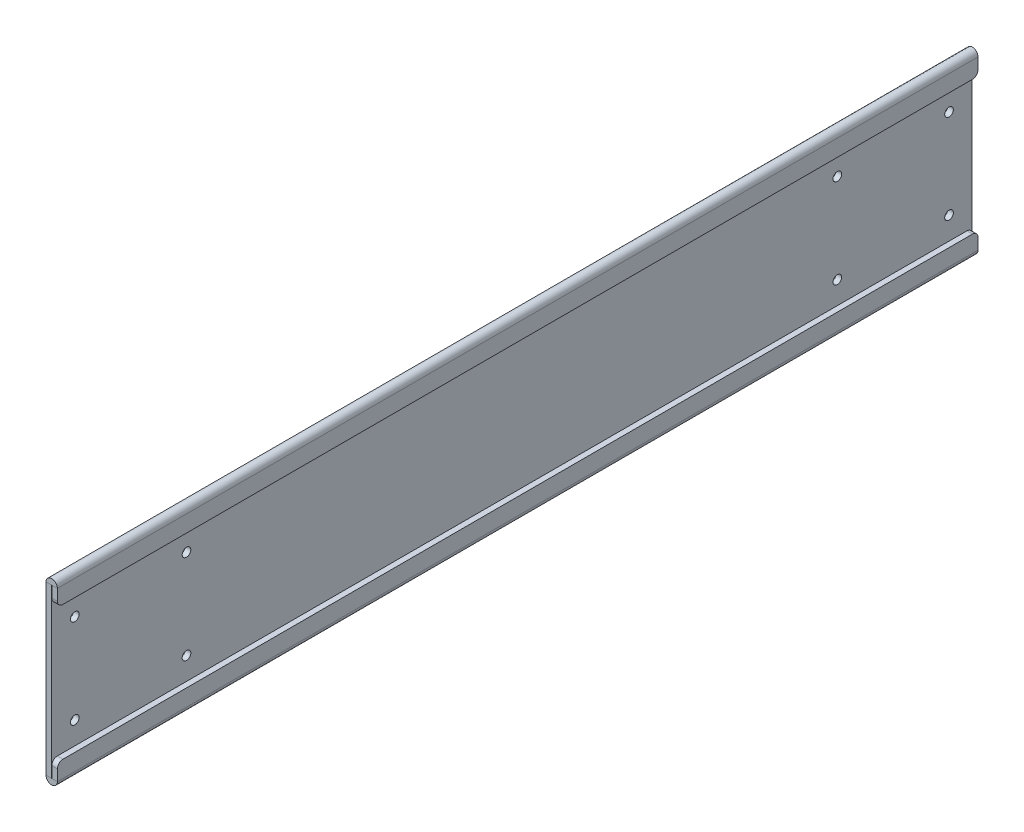
ISO-10303-21;
HEADER;
FILE_DESCRIPTION(('STEP AP214'),'2;1');
FILE_NAME('part.step','',(''),(''),'','','');
FILE_SCHEMA(('AUTOMOTIVE_DESIGN { 1 0 10303 214 1 1 1 1 }'));
ENDSEC;
DATA;
#1=APPLICATION_CONTEXT('core data for automotive mechanical design processes');
#2=APPLICATION_PROTOCOL_DEFINITION('international standard','automotive_design',2000,#1);
#3=PRODUCT_CONTEXT('',#1,'mechanical');
#4=PRODUCT('Part','Part','',(#3));
#5=PRODUCT_RELATED_PRODUCT_CATEGORY('part','',(#4));
#6=PRODUCT_DEFINITION_FORMATION('','',#4);
#7=PRODUCT_DEFINITION_CONTEXT('part definition',#1,'design');
#8=PRODUCT_DEFINITION('design','',#6,#7);
#9=PRODUCT_DEFINITION_SHAPE('','',#8);
#10=(LENGTH_UNIT() NAMED_UNIT(*) SI_UNIT(.MILLI.,.METRE.));
#11=(NAMED_UNIT(*) PLANE_ANGLE_UNIT() SI_UNIT($,.RADIAN.));
#12=(NAMED_UNIT(*) SI_UNIT($,.STERADIAN.) SOLID_ANGLE_UNIT());
#13=UNCERTAINTY_MEASURE_WITH_UNIT(LENGTH_MEASURE(1.E-05),#10,'distance_accuracy_value','');
#14=(GEOMETRIC_REPRESENTATION_CONTEXT(3) GLOBAL_UNCERTAINTY_ASSIGNED_CONTEXT((#13)) GLOBAL_UNIT_ASSIGNED_CONTEXT((#10,
#11,#12)) REPRESENTATION_CONTEXT('',''));
#15=CARTESIAN_POINT('',(0.,0.,0.));
#16=DIRECTION('',(0.,0.,1.));
#17=DIRECTION('',(1.,0.,0.));
#18=AXIS2_PLACEMENT_3D('',#15,#16,#17);
#19=CARTESIAN_POINT('',(-3.175,0.,0.));
#20=DIRECTION('',(0.,0.,-1.));
#21=DIRECTION('',(-1.,0.,0.));
#22=AXIS2_PLACEMENT_3D('',#19,#20,#21);
#23=PLANE('',#22);
#24=DIRECTION('',(0.,1.,0.));
#25=VECTOR('',#24,1.);
#26=CARTESIAN_POINT('',(0.,0.,0.));
#27=LINE('',#26,#25);
#28=CARTESIAN_POINT('',(0.,3.225,0.));
#29=VERTEX_POINT('',#28);
#30=CARTESIAN_POINT('',(0.,98.3749999999999,0.));
#31=VERTEX_POINT('',#30);
#32=EDGE_CURVE('E321',#29,#31,#27,.T.);
#33=ORIENTED_EDGE('',*,*,#32,.F.);
#34=DIRECTION('',(-1.,0.,0.));
#35=VECTOR('',#34,1.);
#36=CARTESIAN_POINT('',(0.,3.225,0.));
#37=LINE('',#36,#35);
#38=CARTESIAN_POINT('',(-3.175,3.225,0.));
#39=VERTEX_POINT('',#38);
#40=EDGE_CURVE('E191',#29,#39,#37,.T.);
#41=ORIENTED_EDGE('',*,*,#40,.T.);
#42=DIRECTION('',(0.,1.,0.));
#43=VECTOR('',#42,1.);
#44=CARTESIAN_POINT('',(-3.175,0.,0.));
#45=LINE('',#44,#43);
#46=CARTESIAN_POINT('',(-3.175,98.3749999999991,0.));
#47=VERTEX_POINT('',#46);
#48=EDGE_CURVE('E170',#39,#47,#45,.T.);
#49=ORIENTED_EDGE('',*,*,#48,.T.);
#50=DIRECTION('',(-1.,-2.7755575615629E-13,0.));
#51=VECTOR('',#50,1.);
#52=CARTESIAN_POINT('',(0.,98.3749999999999,0.));
#53=LINE('',#52,#51);
#54=EDGE_CURVE('E244',#31,#47,#53,.T.);
#55=ORIENTED_EDGE('',*,*,#54,.F.);
#56=EDGE_LOOP('',(#33,#41,#49,#55));
#57=FACE_BOUND('',#56,.T.);
#58=ADVANCED_FACE('F41',(#57),#23,.T.);
#59=CARTESIAN_POINT('',(-3.175,0.,523.3416));
#60=DIRECTION('',(0.,0.,1.));
#61=DIRECTION('',(1.,0.,0.));
#62=AXIS2_PLACEMENT_3D('',#59,#60,#61);
#63=PLANE('',#62);
#64=DIRECTION('',(-1.,0.,0.));
#65=VECTOR('',#64,1.);
#66=CARTESIAN_POINT('',(0.,3.225,523.3416));
#67=LINE('',#66,#65);
#68=CARTESIAN_POINT('',(0.,3.225,523.3416));
#69=VERTEX_POINT('',#68);
#70=CARTESIAN_POINT('',(-3.175,3.22500000000003,523.3416));
#71=VERTEX_POINT('',#70);
#72=EDGE_CURVE('E162',#69,#71,#67,.T.);
#73=ORIENTED_EDGE('',*,*,#72,.F.);
#74=DIRECTION('',(0.,-1.,0.));
#75=VECTOR('',#74,1.);
#76=CARTESIAN_POINT('',(0.,0.,523.3416));
#77=LINE('',#76,#75);
#78=CARTESIAN_POINT('',(0.,98.3749999999999,523.3416));
#79=VERTEX_POINT('',#78);
#80=EDGE_CURVE('E324',#79,#69,#77,.T.);
#81=ORIENTED_EDGE('',*,*,#80,.F.);
#82=DIRECTION('',(-1.,-2.7755575615629E-13,0.));
#83=VECTOR('',#82,1.);
#84=CARTESIAN_POINT('',(0.,98.3749999999999,523.3416));
#85=LINE('',#84,#83);
#86=CARTESIAN_POINT('',(-3.175,98.3749999999999,523.3416));
#87=VERTEX_POINT('',#86);
#88=EDGE_CURVE('E165',#79,#87,#85,.T.);
#89=ORIENTED_EDGE('',*,*,#88,.T.);
#90=DIRECTION('',(0.,-1.,0.));
#91=VECTOR('',#90,1.);
#92=CARTESIAN_POINT('',(-3.175,0.,523.3416));
#93=LINE('',#92,#91);
#94=EDGE_CURVE('E157',#87,#71,#93,.T.);
#95=ORIENTED_EDGE('',*,*,#94,.T.);
#96=EDGE_LOOP('',(#73,#81,#89,#95));
#97=FACE_BOUND('',#96,.T.);
#98=ADVANCED_FACE('F159',(#97),#63,.T.);
#99=CARTESIAN_POINT('',(-3.175,0.,0.));
#100=DIRECTION('',(1.,0.,0.));
#101=DIRECTION('',(0.,0.,-1.));
#102=AXIS2_PLACEMENT_3D('',#99,#100,#101);
#103=PLANE('',#102);
#104=CARTESIAN_POINT('',(-3.175,76.2,13.19149));
#105=DIRECTION('',(1.,0.,0.));
#106=DIRECTION('',(0.,0.,1.));
#107=AXIS2_PLACEMENT_3D('',#104,#105,#106);
#108=CIRCLE('',#107,2.45745000000001);
#109=CARTESIAN_POINT('',(-3.175,76.2,15.64894));
#110=VERTEX_POINT('',#109);
#111=EDGE_CURVE('E276',#110,#110,#108,.T.);
#112=ORIENTED_EDGE('',*,*,#111,.T.);
#113=EDGE_LOOP('',(#112));
#114=FACE_BOUND('',#113,.T.);
#115=CARTESIAN_POINT('',(-3.175,25.4,13.19149));
#116=DIRECTION('',(1.,0.,0.));
#117=DIRECTION('',(0.,0.,1.));
#118=AXIS2_PLACEMENT_3D('',#115,#116,#117);
#119=CIRCLE('',#118,2.45745000000001);
#120=CARTESIAN_POINT('',(-3.175,25.4,15.64894));
#121=VERTEX_POINT('',#120);
#122=EDGE_CURVE('E282',#121,#121,#119,.T.);
#123=ORIENTED_EDGE('',*,*,#122,.T.);
#124=EDGE_LOOP('',(#123));
#125=FACE_BOUND('',#124,.T.);
#126=CARTESIAN_POINT('',(-3.175,25.4,76.69149));
#127=DIRECTION('',(1.,0.,0.));
#128=DIRECTION('',(0.,0.,1.));
#129=AXIS2_PLACEMENT_3D('',#126,#127,#128);
#130=CIRCLE('',#129,2.45745000000001);
#131=CARTESIAN_POINT('',(-3.175,25.4,79.14894));
#132=VERTEX_POINT('',#131);
#133=EDGE_CURVE('E288',#132,#132,#130,.T.);
#134=ORIENTED_EDGE('',*,*,#133,.T.);
#135=EDGE_LOOP('',(#134));
#136=FACE_BOUND('',#135,.T.);
#137=CARTESIAN_POINT('',(-3.175,25.3999999999999,510.15011));
#138=DIRECTION('',(1.,0.,0.));
#139=DIRECTION('',(0.,0.,-1.));
#140=AXIS2_PLACEMENT_3D('',#137,#138,#139);
#141=CIRCLE('',#140,2.45745000000001);
#142=CARTESIAN_POINT('',(-3.175,25.3999999999999,507.69266));
#143=VERTEX_POINT('',#142);
#144=EDGE_CURVE('E294',#143,#143,#141,.T.);
#145=ORIENTED_EDGE('',*,*,#144,.T.);
#146=EDGE_LOOP('',(#145));
#147=FACE_BOUND('',#146,.T.);
#148=CARTESIAN_POINT('',(-3.175,25.3999999999999,446.65011));
#149=DIRECTION('',(1.,0.,0.));
#150=DIRECTION('',(0.,0.,-1.));
#151=AXIS2_PLACEMENT_3D('',#148,#149,#150);
#152=CIRCLE('',#151,2.45745000000002);
#153=CARTESIAN_POINT('',(-3.175,25.3999999999999,444.19266));
#154=VERTEX_POINT('',#153);
#155=EDGE_CURVE('E300',#154,#154,#152,.T.);
#156=ORIENTED_EDGE('',*,*,#155,.T.);
#157=EDGE_LOOP('',(#156));
#158=FACE_BOUND('',#157,.T.);
#159=CARTESIAN_POINT('',(-3.175,76.1999999999999,446.65011));
#160=DIRECTION('',(1.,0.,0.));
#161=DIRECTION('',(0.,0.,-1.));
#162=AXIS2_PLACEMENT_3D('',#159,#160,#161);
#163=CIRCLE('',#162,2.45745000000002);
#164=CARTESIAN_POINT('',(-3.175,76.1999999999999,444.19266));
#165=VERTEX_POINT('',#164);
#166=EDGE_CURVE('E306',#165,#165,#163,.T.);
#167=ORIENTED_EDGE('',*,*,#166,.T.);
#168=EDGE_LOOP('',(#167));
#169=FACE_BOUND('',#168,.T.);
#170=CARTESIAN_POINT('',(-3.175,76.2,76.69149));
#171=DIRECTION('',(1.,0.,0.));
#172=DIRECTION('',(0.,0.,1.));
#173=AXIS2_PLACEMENT_3D('',#170,#171,#172);
#174=CIRCLE('',#173,2.45745000000002);
#175=CARTESIAN_POINT('',(-3.175,76.2,79.14894));
#176=VERTEX_POINT('',#175);
#177=EDGE_CURVE('E312',#176,#176,#174,.T.);
#178=ORIENTED_EDGE('',*,*,#177,.T.);
#179=EDGE_LOOP('',(#178));
#180=FACE_BOUND('',#179,.T.);
#181=CARTESIAN_POINT('',(-3.175,76.1999999999999,510.15011));
#182=DIRECTION('',(1.,0.,0.));
#183=DIRECTION('',(0.,0.,-1.));
#184=AXIS2_PLACEMENT_3D('',#181,#182,#183);
#185=CIRCLE('',#184,2.45745000000001);
#186=CARTESIAN_POINT('',(-3.175,76.1999999999999,507.69266));
#187=VERTEX_POINT('',#186);
#188=EDGE_CURVE('E318',#187,#187,#185,.T.);
#189=ORIENTED_EDGE('',*,*,#188,.T.);
#190=EDGE_LOOP('',(#189));
#191=FACE_BOUND('',#190,.T.);
#192=ORIENTED_EDGE('',*,*,#48,.F.);
#193=DIRECTION('',(0.,0.,-1.));
#194=VECTOR('',#193,1.);
#195=CARTESIAN_POINT('',(-3.175,3.22500000000003,0.));
#196=LINE('',#195,#194);
#197=EDGE_CURVE('E174',#39,#71,#196,.F.);
#198=ORIENTED_EDGE('',*,*,#197,.T.);
#199=ORIENTED_EDGE('',*,*,#94,.F.);
#200=DIRECTION('',(0.,0.,1.));
#201=VECTOR('',#200,1.);
#202=CARTESIAN_POINT('',(-3.175,98.3749999999991,523.3416));
#203=LINE('',#202,#201);
#204=EDGE_CURVE('E228',#87,#47,#203,.F.);
#205=ORIENTED_EDGE('',*,*,#204,.T.);
#206=EDGE_LOOP('',(#192,#198,#199,#205));
#207=FACE_BOUND('',#206,.T.);
#208=ADVANCED_FACE('F175',(#114,#125,#136,#147,#158,#169,#180,#191,#207),#103,.F.);
#209=CARTESIAN_POINT('',(0.,0.,0.));
#210=DIRECTION('',(1.,0.,0.));
#211=DIRECTION('',(0.,0.,-1.));
#212=AXIS2_PLACEMENT_3D('',#209,#210,#211);
#213=PLANE('',#212);
#214=DIRECTION('',(0.,0.,-1.));
#215=VECTOR('',#214,1.);
#216=CARTESIAN_POINT('',(0.,3.225,0.));
#217=LINE('',#216,#215);
#218=EDGE_CURVE('E202',#29,#69,#217,.F.);
#219=ORIENTED_EDGE('',*,*,#218,.F.);
#220=ORIENTED_EDGE('',*,*,#32,.T.);
#221=DIRECTION('',(0.,0.,1.));
#222=VECTOR('',#221,1.);
#223=CARTESIAN_POINT('',(0.,98.3749999999999,523.3416));
#224=LINE('',#223,#222);
#225=EDGE_CURVE('E239',#79,#31,#224,.F.);
#226=ORIENTED_EDGE('',*,*,#225,.F.);
#227=ORIENTED_EDGE('',*,*,#80,.T.);
#228=EDGE_LOOP('',(#219,#220,#226,#227));
#229=FACE_BOUND('',#228,.T.);
#230=CARTESIAN_POINT('',(0.,76.2,13.19149));
#231=DIRECTION('',(1.,0.,0.));
#232=DIRECTION('',(0.,0.,1.));
#233=AXIS2_PLACEMENT_3D('',#230,#231,#232);
#234=CIRCLE('',#233,2.45745000000001);
#235=CARTESIAN_POINT('',(0.,76.2,15.64894));
#236=VERTEX_POINT('',#235);
#237=EDGE_CURVE('E275',#236,#236,#234,.T.);
#238=ORIENTED_EDGE('',*,*,#237,.F.);
#239=EDGE_LOOP('',(#238));
#240=FACE_BOUND('',#239,.T.);
#241=CARTESIAN_POINT('',(0.,25.4,13.19149));
#242=DIRECTION('',(1.,0.,0.));
#243=DIRECTION('',(0.,0.,1.));
#244=AXIS2_PLACEMENT_3D('',#241,#242,#243);
#245=CIRCLE('',#244,2.45745000000001);
#246=CARTESIAN_POINT('',(0.,25.4,15.64894));
#247=VERTEX_POINT('',#246);
#248=EDGE_CURVE('E279',#247,#247,#245,.T.);
#249=ORIENTED_EDGE('',*,*,#248,.F.);
#250=EDGE_LOOP('',(#249));
#251=FACE_BOUND('',#250,.T.);
#252=CARTESIAN_POINT('',(0.,25.4,76.69149));
#253=DIRECTION('',(1.,0.,0.));
#254=DIRECTION('',(0.,0.,1.));
#255=AXIS2_PLACEMENT_3D('',#252,#253,#254);
#256=CIRCLE('',#255,2.45745000000001);
#257=CARTESIAN_POINT('',(0.,25.4,79.14894));
#258=VERTEX_POINT('',#257);
#259=EDGE_CURVE('E285',#258,#258,#256,.T.);
#260=ORIENTED_EDGE('',*,*,#259,.F.);
#261=EDGE_LOOP('',(#260));
#262=FACE_BOUND('',#261,.T.);
#263=CARTESIAN_POINT('',(0.,25.3999999999999,510.15011));
#264=DIRECTION('',(1.,0.,0.));
#265=DIRECTION('',(0.,0.,-1.));
#266=AXIS2_PLACEMENT_3D('',#263,#264,#265);
#267=CIRCLE('',#266,2.45745000000001);
#268=CARTESIAN_POINT('',(0.,25.3999999999999,507.69266));
#269=VERTEX_POINT('',#268);
#270=EDGE_CURVE('E291',#269,#269,#267,.T.);
#271=ORIENTED_EDGE('',*,*,#270,.F.);
#272=EDGE_LOOP('',(#271));
#273=FACE_BOUND('',#272,.T.);
#274=CARTESIAN_POINT('',(0.,25.3999999999999,446.65011));
#275=DIRECTION('',(1.,0.,0.));
#276=DIRECTION('',(0.,0.,-1.));
#277=AXIS2_PLACEMENT_3D('',#274,#275,#276);
#278=CIRCLE('',#277,2.45745000000002);
#279=CARTESIAN_POINT('',(0.,25.3999999999999,444.19266));
#280=VERTEX_POINT('',#279);
#281=EDGE_CURVE('E297',#280,#280,#278,.T.);
#282=ORIENTED_EDGE('',*,*,#281,.F.);
#283=EDGE_LOOP('',(#282));
#284=FACE_BOUND('',#283,.T.);
#285=CARTESIAN_POINT('',(0.,76.1999999999999,446.65011));
#286=DIRECTION('',(1.,0.,0.));
#287=DIRECTION('',(0.,0.,-1.));
#288=AXIS2_PLACEMENT_3D('',#285,#286,#287);
#289=CIRCLE('',#288,2.45745000000002);
#290=CARTESIAN_POINT('',(0.,76.1999999999999,444.19266));
#291=VERTEX_POINT('',#290);
#292=EDGE_CURVE('E303',#291,#291,#289,.T.);
#293=ORIENTED_EDGE('',*,*,#292,.F.);
#294=EDGE_LOOP('',(#293));
#295=FACE_BOUND('',#294,.T.);
#296=CARTESIAN_POINT('',(0.,76.2,76.69149));
#297=DIRECTION('',(1.,0.,0.));
#298=DIRECTION('',(0.,0.,1.));
#299=AXIS2_PLACEMENT_3D('',#296,#297,#298);
#300=CIRCLE('',#299,2.45745000000002);
#301=CARTESIAN_POINT('',(0.,76.2,79.14894));
#302=VERTEX_POINT('',#301);
#303=EDGE_CURVE('E309',#302,#302,#300,.T.);
#304=ORIENTED_EDGE('',*,*,#303,.F.);
#305=EDGE_LOOP('',(#304));
#306=FACE_BOUND('',#305,.T.);
#307=CARTESIAN_POINT('',(0.,76.1999999999999,510.15011));
#308=DIRECTION('',(1.,0.,0.));
#309=DIRECTION('',(0.,0.,-1.));
#310=AXIS2_PLACEMENT_3D('',#307,#308,#309);
#311=CIRCLE('',#310,2.45745000000001);
#312=CARTESIAN_POINT('',(0.,76.1999999999999,507.69266));
#313=VERTEX_POINT('',#312);
#314=EDGE_CURVE('E315',#313,#313,#311,.T.);
#315=ORIENTED_EDGE('',*,*,#314,.F.);
#316=EDGE_LOOP('',(#315));
#317=FACE_BOUND('',#316,.T.);
#318=ADVANCED_FACE('F382',(#229,#240,#251,#262,#273,#284,#295,#306,#317),#213,.T.);
#319=CARTESIAN_POINT('',(-3.175,76.1999999999999,510.15011));
#320=DIRECTION('',(1.,0.,0.));
#321=DIRECTION('',(0.,0.,-1.));
#322=AXIS2_PLACEMENT_3D('',#319,#320,#321);
#323=CYLINDRICAL_SURFACE('',#322,2.45745000000001);
#324=ORIENTED_EDGE('',*,*,#188,.F.);
#325=EDGE_LOOP('',(#324));
#326=FACE_BOUND('',#325,.T.);
#327=ORIENTED_EDGE('',*,*,#314,.T.);
#328=EDGE_LOOP('',(#327));
#329=FACE_BOUND('',#328,.T.);
#330=ADVANCED_FACE('F497',(#326,#329),#323,.F.);
#331=CARTESIAN_POINT('',(-3.175,76.2,76.69149));
#332=DIRECTION('',(1.,0.,0.));
#333=DIRECTION('',(0.,0.,-1.));
#334=AXIS2_PLACEMENT_3D('',#331,#332,#333);
#335=CYLINDRICAL_SURFACE('',#334,2.45745000000002);
#336=ORIENTED_EDGE('',*,*,#177,.F.);
#337=EDGE_LOOP('',(#336));
#338=FACE_BOUND('',#337,.T.);
#339=ORIENTED_EDGE('',*,*,#303,.T.);
#340=EDGE_LOOP('',(#339));
#341=FACE_BOUND('',#340,.T.);
#342=ADVANCED_FACE('F493',(#338,#341),#335,.F.);
#343=CARTESIAN_POINT('',(-3.175,76.1999999999999,446.65011));
#344=DIRECTION('',(1.,0.,0.));
#345=DIRECTION('',(0.,0.,-1.));
#346=AXIS2_PLACEMENT_3D('',#343,#344,#345);
#347=CYLINDRICAL_SURFACE('',#346,2.45745000000002);
#348=ORIENTED_EDGE('',*,*,#166,.F.);
#349=EDGE_LOOP('',(#348));
#350=FACE_BOUND('',#349,.T.);
#351=ORIENTED_EDGE('',*,*,#292,.T.);
#352=EDGE_LOOP('',(#351));
#353=FACE_BOUND('',#352,.T.);
#354=ADVANCED_FACE('F489',(#350,#353),#347,.F.);
#355=CARTESIAN_POINT('',(-3.175,25.3999999999999,446.65011));
#356=DIRECTION('',(1.,0.,0.));
#357=DIRECTION('',(0.,0.,-1.));
#358=AXIS2_PLACEMENT_3D('',#355,#356,#357);
#359=CYLINDRICAL_SURFACE('',#358,2.45745000000002);
#360=ORIENTED_EDGE('',*,*,#155,.F.);
#361=EDGE_LOOP('',(#360));
#362=FACE_BOUND('',#361,.T.);
#363=ORIENTED_EDGE('',*,*,#281,.T.);
#364=EDGE_LOOP('',(#363));
#365=FACE_BOUND('',#364,.T.);
#366=ADVANCED_FACE('F485',(#362,#365),#359,.F.);
#367=CARTESIAN_POINT('',(-3.175,25.3999999999999,510.15011));
#368=DIRECTION('',(1.,0.,0.));
#369=DIRECTION('',(0.,0.,-1.));
#370=AXIS2_PLACEMENT_3D('',#367,#368,#369);
#371=CYLINDRICAL_SURFACE('',#370,2.45745000000001);
#372=ORIENTED_EDGE('',*,*,#144,.F.);
#373=EDGE_LOOP('',(#372));
#374=FACE_BOUND('',#373,.T.);
#375=ORIENTED_EDGE('',*,*,#270,.T.);
#376=EDGE_LOOP('',(#375));
#377=FACE_BOUND('',#376,.T.);
#378=ADVANCED_FACE('F481',(#374,#377),#371,.F.);
#379=CARTESIAN_POINT('',(-3.175,25.4,76.69149));
#380=DIRECTION('',(1.,0.,0.));
#381=DIRECTION('',(0.,0.,-1.));
#382=AXIS2_PLACEMENT_3D('',#379,#380,#381);
#383=CYLINDRICAL_SURFACE('',#382,2.45745000000001);
#384=ORIENTED_EDGE('',*,*,#133,.F.);
#385=EDGE_LOOP('',(#384));
#386=FACE_BOUND('',#385,.T.);
#387=ORIENTED_EDGE('',*,*,#259,.T.);
#388=EDGE_LOOP('',(#387));
#389=FACE_BOUND('',#388,.T.);
#390=ADVANCED_FACE('F477',(#386,#389),#383,.F.);
#391=CARTESIAN_POINT('',(-3.175,25.4,13.19149));
#392=DIRECTION('',(1.,0.,0.));
#393=DIRECTION('',(0.,0.,-1.));
#394=AXIS2_PLACEMENT_3D('',#391,#392,#393);
#395=CYLINDRICAL_SURFACE('',#394,2.45745000000001);
#396=ORIENTED_EDGE('',*,*,#122,.F.);
#397=EDGE_LOOP('',(#396));
#398=FACE_BOUND('',#397,.T.);
#399=ORIENTED_EDGE('',*,*,#248,.T.);
#400=EDGE_LOOP('',(#399));
#401=FACE_BOUND('',#400,.T.);
#402=ADVANCED_FACE('F473',(#398,#401),#395,.F.);
#403=CARTESIAN_POINT('',(-3.175,76.2,13.19149));
#404=DIRECTION('',(1.,0.,0.));
#405=DIRECTION('',(0.,0.,-1.));
#406=AXIS2_PLACEMENT_3D('',#403,#404,#405);
#407=CYLINDRICAL_SURFACE('',#406,2.45745000000001);
#408=ORIENTED_EDGE('',*,*,#111,.F.);
#409=EDGE_LOOP('',(#408));
#410=FACE_BOUND('',#409,.T.);
#411=ORIENTED_EDGE('',*,*,#237,.T.);
#412=EDGE_LOOP('',(#411));
#413=FACE_BOUND('',#412,.T.);
#414=ADVANCED_FACE('F470',(#410,#413),#407,.F.);
#415=CARTESIAN_POINT('',(3.275,93.6374999999999,523.3416));
#416=DIRECTION('',(0.,0.,-1.));
#417=DIRECTION('',(0.,1.,0.));
#418=AXIS2_PLACEMENT_3D('',#415,#416,#417);
#419=PLANE('',#418);
#420=DIRECTION('',(0.,1.,0.));
#421=VECTOR('',#420,1.);
#422=CARTESIAN_POINT('',(0.0999999999999998,93.6375,523.3416));
#423=LINE('',#422,#421);
#424=CARTESIAN_POINT('',(0.0999999999999998,92.0749999999999,523.3416));
#425=VERTEX_POINT('',#424);
#426=CARTESIAN_POINT('',(0.0999999999999998,98.3749999999999,523.3416));
#427=VERTEX_POINT('',#426);
#428=EDGE_CURVE('E264',#425,#427,#423,.T.);
#429=ORIENTED_EDGE('',*,*,#428,.F.);
#430=DIRECTION('',(-1.,0.,0.));
#431=VECTOR('',#430,1.);
#432=CARTESIAN_POINT('',(3.275,92.0749999999999,523.3416));
#433=LINE('',#432,#431);
#434=CARTESIAN_POINT('',(3.275,92.0749999999999,523.3416));
#435=VERTEX_POINT('',#434);
#436=EDGE_CURVE('E11',#425,#435,#433,.F.);
#437=ORIENTED_EDGE('',*,*,#436,.T.);
#438=DIRECTION('',(0.,1.,0.));
#439=VECTOR('',#438,1.);
#440=CARTESIAN_POINT('',(3.275,93.6374999999999,523.3416));
#441=LINE('',#440,#439);
#442=CARTESIAN_POINT('',(3.275,98.3749999999999,523.3416));
#443=VERTEX_POINT('',#442);
#444=EDGE_CURVE('E253',#435,#443,#441,.T.);
#445=ORIENTED_EDGE('',*,*,#444,.T.);
#446=DIRECTION('',(1.,0.,0.));
#447=VECTOR('',#446,1.);
#448=CARTESIAN_POINT('',(3.275,98.3749999999999,523.3416));
#449=LINE('',#448,#447);
#450=EDGE_CURVE('E252',#427,#443,#449,.T.);
#451=ORIENTED_EDGE('',*,*,#450,.F.);
#452=EDGE_LOOP('',(#429,#437,#445,#451));
#453=FACE_BOUND('',#452,.T.);
#454=ADVANCED_FACE('F428',(#453),#419,.F.);
#455=CARTESIAN_POINT('',(3.275,88.8999999999999,261.6708));
#456=DIRECTION('',(0.,1.,0.));
#457=DIRECTION('',(0.,0.,1.));
#458=AXIS2_PLACEMENT_3D('',#455,#456,#457);
#459=PLANE('',#458);
#460=DIRECTION('',(0.,0.,-1.));
#461=VECTOR('',#460,1.);
#462=CARTESIAN_POINT('',(0.0999999999999998,88.9,261.6708));
#463=LINE('',#462,#461);
#464=CARTESIAN_POINT('',(0.0999999999999998,88.9,3.17499999999998));
#465=VERTEX_POINT('',#464);
#466=CARTESIAN_POINT('',(0.0999999999999998,88.9,520.1666));
#467=VERTEX_POINT('',#466);
#468=EDGE_CURVE('E261',#465,#467,#463,.F.);
#469=ORIENTED_EDGE('',*,*,#468,.F.);
#470=DIRECTION('',(-1.,0.,0.));
#471=VECTOR('',#470,1.);
#472=CARTESIAN_POINT('',(3.275,88.9,3.17499999999998));
#473=LINE('',#472,#471);
#474=CARTESIAN_POINT('',(3.275,88.9,3.17499999999998));
#475=VERTEX_POINT('',#474);
#476=EDGE_CURVE('E329',#465,#475,#473,.F.);
#477=ORIENTED_EDGE('',*,*,#476,.T.);
#478=DIRECTION('',(0.,0.,1.));
#479=VECTOR('',#478,1.);
#480=CARTESIAN_POINT('',(3.275,88.8999999999999,261.6708));
#481=LINE('',#480,#479);
#482=CARTESIAN_POINT('',(3.275,88.8999999999999,520.1666));
#483=VERTEX_POINT('',#482);
#484=EDGE_CURVE('E249',#475,#483,#481,.T.);
#485=ORIENTED_EDGE('',*,*,#484,.T.);
#486=DIRECTION('',(-1.,0.,0.));
#487=VECTOR('',#486,1.);
#488=CARTESIAN_POINT('',(3.275,88.8999999999999,520.1666));
#489=LINE('',#488,#487);
#490=EDGE_CURVE('E169',#483,#467,#489,.T.);
#491=ORIENTED_EDGE('',*,*,#490,.T.);
#492=EDGE_LOOP('',(#469,#477,#485,#491));
#493=FACE_BOUND('',#492,.T.);
#494=ADVANCED_FACE('F453',(#493),#459,.F.);
#495=CARTESIAN_POINT('',(3.275,93.6375,0.));
#496=DIRECTION('',(0.,0.,1.));
#497=DIRECTION('',(0.,-1.,0.));
#498=AXIS2_PLACEMENT_3D('',#495,#496,#497);
#499=PLANE('',#498);
#500=DIRECTION('',(0.,-1.,0.));
#501=VECTOR('',#500,1.);
#502=CARTESIAN_POINT('',(3.275,93.6375,0.));
#503=LINE('',#502,#501);
#504=CARTESIAN_POINT('',(3.275,98.3749999999999,0.));
#505=VERTEX_POINT('',#504);
#506=CARTESIAN_POINT('',(3.275,92.075,0.));
#507=VERTEX_POINT('',#506);
#508=EDGE_CURVE('E258',#505,#507,#503,.T.);
#509=ORIENTED_EDGE('',*,*,#508,.T.);
#510=DIRECTION('',(-1.,0.,0.));
#511=VECTOR('',#510,1.);
#512=CARTESIAN_POINT('',(3.275,92.075,0.));
#513=LINE('',#512,#511);
#514=CARTESIAN_POINT('',(0.0999999999999998,92.075,0.));
#515=VERTEX_POINT('',#514);
#516=EDGE_CURVE('E336',#507,#515,#513,.T.);
#517=ORIENTED_EDGE('',*,*,#516,.T.);
#518=DIRECTION('',(0.,1.,0.));
#519=VECTOR('',#518,1.);
#520=CARTESIAN_POINT('',(0.0999999999999998,93.6375,0.));
#521=LINE('',#520,#519);
#522=CARTESIAN_POINT('',(0.0999999999999998,98.375,0.));
#523=VERTEX_POINT('',#522);
#524=EDGE_CURVE('E247',#523,#515,#521,.F.);
#525=ORIENTED_EDGE('',*,*,#524,.F.);
#526=DIRECTION('',(1.,0.,0.));
#527=VECTOR('',#526,1.);
#528=CARTESIAN_POINT('',(3.275,98.375,0.));
#529=LINE('',#528,#527);
#530=EDGE_CURVE('E272',#523,#505,#529,.T.);
#531=ORIENTED_EDGE('',*,*,#530,.T.);
#532=EDGE_LOOP('',(#509,#517,#525,#531));
#533=FACE_BOUND('',#532,.T.);
#534=ADVANCED_FACE('F447',(#533),#499,.F.);
#535=CARTESIAN_POINT('',(3.275,93.6375,261.6708));
#536=DIRECTION('',(1.,0.,0.));
#537=DIRECTION('',(0.,0.,-1.));
#538=AXIS2_PLACEMENT_3D('',#535,#536,#537);
#539=PLANE('',#538);
#540=ORIENTED_EDGE('',*,*,#484,.F.);
#541=CARTESIAN_POINT('',(3.275,92.075,3.17499999999998));
#542=DIRECTION('',(1.,0.,0.));
#543=DIRECTION('',(0.,0.,-1.));
#544=AXIS2_PLACEMENT_3D('',#541,#542,#543);
#545=CIRCLE('',#544,3.175);
#546=EDGE_CURVE('E334',#475,#507,#545,.T.);
#547=ORIENTED_EDGE('',*,*,#546,.T.);
#548=ORIENTED_EDGE('',*,*,#508,.F.);
#549=DIRECTION('',(0.,0.,-1.));
#550=VECTOR('',#549,1.);
#551=CARTESIAN_POINT('',(3.275,98.375,261.6708));
#552=LINE('',#551,#550);
#553=EDGE_CURVE('E255',#443,#505,#552,.T.);
#554=ORIENTED_EDGE('',*,*,#553,.F.);
#555=ORIENTED_EDGE('',*,*,#444,.F.);
#556=CARTESIAN_POINT('',(3.275,92.0749999999999,520.1666));
#557=DIRECTION('',(1.,0.,0.));
#558=DIRECTION('',(0.,0.,-1.));
#559=AXIS2_PLACEMENT_3D('',#556,#557,#558);
#560=CIRCLE('',#559,3.175);
#561=EDGE_CURVE('E332',#435,#483,#560,.T.);
#562=ORIENTED_EDGE('',*,*,#561,.T.);
#563=EDGE_LOOP('',(#540,#547,#548,#554,#555,#562));
#564=FACE_BOUND('',#563,.T.);
#565=ADVANCED_FACE('F455',(#564),#539,.T.);
#566=CARTESIAN_POINT('',(0.0999999999999998,93.6375,261.6708));
#567=DIRECTION('',(1.,0.,0.));
#568=DIRECTION('',(0.,0.,-1.));
#569=AXIS2_PLACEMENT_3D('',#566,#567,#568);
#570=PLANE('',#569);
#571=ORIENTED_EDGE('',*,*,#524,.T.);
#572=CARTESIAN_POINT('',(0.0999999999999998,92.075,3.17499999999998));
#573=DIRECTION('',(1.,0.,0.));
#574=DIRECTION('',(0.,0.,-1.));
#575=AXIS2_PLACEMENT_3D('',#572,#573,#574);
#576=CIRCLE('',#575,3.175);
#577=EDGE_CURVE('E340',#515,#465,#576,.F.);
#578=ORIENTED_EDGE('',*,*,#577,.T.);
#579=ORIENTED_EDGE('',*,*,#468,.T.);
#580=CARTESIAN_POINT('',(0.0999999999999998,92.0749999999999,520.1666));
#581=DIRECTION('',(1.,0.,0.));
#582=DIRECTION('',(0.,0.,-1.));
#583=AXIS2_PLACEMENT_3D('',#580,#581,#582);
#584=CIRCLE('',#583,3.175);
#585=EDGE_CURVE('E338',#467,#425,#584,.F.);
#586=ORIENTED_EDGE('',*,*,#585,.T.);
#587=ORIENTED_EDGE('',*,*,#428,.T.);
#588=DIRECTION('',(0.,0.,-1.));
#589=VECTOR('',#588,1.);
#590=CARTESIAN_POINT('',(0.0999999999999998,98.3749999999999,261.6708));
#591=LINE('',#590,#589);
#592=EDGE_CURVE('E266',#427,#523,#591,.T.);
#593=ORIENTED_EDGE('',*,*,#592,.T.);
#594=EDGE_LOOP('',(#571,#578,#579,#586,#587,#593));
#595=FACE_BOUND('',#594,.T.);
#596=ADVANCED_FACE('F424',(#595),#570,.F.);
#597=CARTESIAN_POINT('',(0.0499999999999999,98.3749999999999,0.));
#598=DIRECTION('',(0.,0.,-1.));
#599=DIRECTION('',(-1.,0.,0.));
#600=AXIS2_PLACEMENT_3D('',#597,#598,#599);
#601=PLANE('',#600);
#602=ORIENTED_EDGE('',*,*,#530,.F.);
#603=CARTESIAN_POINT('',(0.0499999999999999,98.3749999999999,0.));
#604=DIRECTION('',(0.,0.,1.));
#605=DIRECTION('',(1.,0.,0.));
#606=AXIS2_PLACEMENT_3D('',#603,#604,#605);
#607=CIRCLE('',#606,0.0499999999999999);
#608=EDGE_CURVE('E236',#31,#523,#607,.F.);
#609=ORIENTED_EDGE('',*,*,#608,.F.);
#610=ORIENTED_EDGE('',*,*,#54,.T.);
#611=CARTESIAN_POINT('',(0.0499999999999999,98.3749999999999,0.));
#612=DIRECTION('',(0.,0.,1.));
#613=DIRECTION('',(1.,0.,0.));
#614=AXIS2_PLACEMENT_3D('',#611,#612,#613);
#615=CIRCLE('',#614,3.225);
#616=EDGE_CURVE('E230',#47,#505,#615,.F.);
#617=ORIENTED_EDGE('',*,*,#616,.T.);
#618=EDGE_LOOP('',(#602,#609,#610,#617));
#619=FACE_BOUND('',#618,.T.);
#620=ADVANCED_FACE('F445',(#619),#601,.T.);
#621=CARTESIAN_POINT('',(0.0499999999999999,98.3749999999999,523.3416));
#622=DIRECTION('',(0.,0.,-1.));
#623=DIRECTION('',(-1.,0.,0.));
#624=AXIS2_PLACEMENT_3D('',#621,#622,#623);
#625=PLANE('',#624);
#626=CARTESIAN_POINT('',(0.0499999999999999,98.3749999999999,523.3416));
#627=DIRECTION('',(0.,0.,1.));
#628=DIRECTION('',(1.,0.,0.));
#629=AXIS2_PLACEMENT_3D('',#626,#627,#628);
#630=CIRCLE('',#629,0.0499999999999999);
#631=EDGE_CURVE('E227',#427,#79,#630,.T.);
#632=ORIENTED_EDGE('',*,*,#631,.F.);
#633=ORIENTED_EDGE('',*,*,#450,.T.);
#634=CARTESIAN_POINT('',(0.0499999999999999,98.3749999999999,523.3416));
#635=DIRECTION('',(0.,0.,1.));
#636=DIRECTION('',(1.,0.,0.));
#637=AXIS2_PLACEMENT_3D('',#634,#635,#636);
#638=CIRCLE('',#637,3.225);
#639=EDGE_CURVE('E231',#443,#87,#638,.T.);
#640=ORIENTED_EDGE('',*,*,#639,.T.);
#641=ORIENTED_EDGE('',*,*,#88,.F.);
#642=EDGE_LOOP('',(#632,#633,#640,#641));
#643=FACE_BOUND('',#642,.T.);
#644=ADVANCED_FACE('F439',(#643),#625,.F.);
#645=CARTESIAN_POINT('',(0.0499999999999999,98.3749999999999,523.3416));
#646=DIRECTION('',(0.,0.,1.));
#647=DIRECTION('',(1.,0.,0.));
#648=AXIS2_PLACEMENT_3D('',#645,#646,#647);
#649=CYLINDRICAL_SURFACE('',#648,3.225);
#650=ORIENTED_EDGE('',*,*,#204,.F.);
#651=ORIENTED_EDGE('',*,*,#639,.F.);
#652=ORIENTED_EDGE('',*,*,#553,.T.);
#653=ORIENTED_EDGE('',*,*,#616,.F.);
#654=EDGE_LOOP('',(#650,#651,#652,#653));
#655=FACE_BOUND('',#654,.T.);
#656=ADVANCED_FACE('F441',(#655),#649,.T.);
#657=CARTESIAN_POINT('',(0.0499999999999999,98.3749999999999,523.3416));
#658=DIRECTION('',(0.,0.,1.));
#659=DIRECTION('',(1.,0.,0.));
#660=AXIS2_PLACEMENT_3D('',#657,#658,#659);
#661=CYLINDRICAL_SURFACE('',#660,0.0499999999999999);
#662=ORIENTED_EDGE('',*,*,#225,.T.);
#663=ORIENTED_EDGE('',*,*,#608,.T.);
#664=ORIENTED_EDGE('',*,*,#592,.F.);
#665=ORIENTED_EDGE('',*,*,#631,.T.);
#666=EDGE_LOOP('',(#662,#663,#664,#665));
#667=FACE_BOUND('',#666,.T.);
#668=ADVANCED_FACE('F436',(#667),#661,.F.);
#669=CARTESIAN_POINT('',(3.275,7.9625,0.));
#670=DIRECTION('',(0.,0.,1.));
#671=DIRECTION('',(0.,-1.,0.));
#672=AXIS2_PLACEMENT_3D('',#669,#670,#671);
#673=PLANE('',#672);
#674=DIRECTION('',(0.,1.,0.));
#675=VECTOR('',#674,1.);
#676=CARTESIAN_POINT('',(0.0999999999999998,7.9625,0.));
#677=LINE('',#676,#675);
#678=CARTESIAN_POINT('',(0.0999999999999998,9.525,0.));
#679=VERTEX_POINT('',#678);
#680=CARTESIAN_POINT('',(0.0999999999999998,3.225,0.));
#681=VERTEX_POINT('',#680);
#682=EDGE_CURVE('E217',#679,#681,#677,.F.);
#683=ORIENTED_EDGE('',*,*,#682,.F.);
#684=DIRECTION('',(-1.,0.,0.));
#685=VECTOR('',#684,1.);
#686=CARTESIAN_POINT('',(3.275,9.525,0.));
#687=LINE('',#686,#685);
#688=CARTESIAN_POINT('',(3.275,9.525,0.));
#689=VERTEX_POINT('',#688);
#690=EDGE_CURVE('E342',#679,#689,#687,.F.);
#691=ORIENTED_EDGE('',*,*,#690,.T.);
#692=DIRECTION('',(0.,-1.,0.));
#693=VECTOR('',#692,1.);
#694=CARTESIAN_POINT('',(3.275,7.9625,0.));
#695=LINE('',#694,#693);
#696=CARTESIAN_POINT('',(3.275,3.225,0.));
#697=VERTEX_POINT('',#696);
#698=EDGE_CURVE('E210',#689,#697,#695,.T.);
#699=ORIENTED_EDGE('',*,*,#698,.T.);
#700=DIRECTION('',(1.,0.,0.));
#701=VECTOR('',#700,1.);
#702=CARTESIAN_POINT('',(3.275,3.225,0.));
#703=LINE('',#702,#701);
#704=EDGE_CURVE('E209',#681,#697,#703,.T.);
#705=ORIENTED_EDGE('',*,*,#704,.F.);
#706=EDGE_LOOP('',(#683,#691,#699,#705));
#707=FACE_BOUND('',#706,.T.);
#708=ADVANCED_FACE('F364',(#707),#673,.F.);
#709=CARTESIAN_POINT('',(3.275,12.7,261.6708));
#710=DIRECTION('',(0.,-1.,0.));
#711=DIRECTION('',(0.,0.,-1.));
#712=AXIS2_PLACEMENT_3D('',#709,#710,#711);
#713=PLANE('',#712);
#714=DIRECTION('',(0.,0.,-1.));
#715=VECTOR('',#714,1.);
#716=CARTESIAN_POINT('',(3.275,12.7,261.6708));
#717=LINE('',#716,#715);
#718=CARTESIAN_POINT('',(3.275,12.7,520.1666));
#719=VERTEX_POINT('',#718);
#720=CARTESIAN_POINT('',(3.275,12.7,3.17499999999998));
#721=VERTEX_POINT('',#720);
#722=EDGE_CURVE('E207',#719,#721,#717,.T.);
#723=ORIENTED_EDGE('',*,*,#722,.T.);
#724=DIRECTION('',(-1.,0.,0.));
#725=VECTOR('',#724,1.);
#726=CARTESIAN_POINT('',(3.275,12.7,3.17499999999998));
#727=LINE('',#726,#725);
#728=CARTESIAN_POINT('',(0.0999999999999998,12.7,3.17499999999998));
#729=VERTEX_POINT('',#728);
#730=EDGE_CURVE('E63',#721,#729,#727,.T.);
#731=ORIENTED_EDGE('',*,*,#730,.T.);
#732=DIRECTION('',(0.,0.,-1.));
#733=VECTOR('',#732,1.);
#734=CARTESIAN_POINT('',(0.0999999999999998,12.7,261.6708));
#735=LINE('',#734,#733);
#736=CARTESIAN_POINT('',(0.0999999999999998,12.7,520.1666));
#737=VERTEX_POINT('',#736);
#738=EDGE_CURVE('E215',#737,#729,#735,.T.);
#739=ORIENTED_EDGE('',*,*,#738,.F.);
#740=DIRECTION('',(-1.,0.,0.));
#741=VECTOR('',#740,1.);
#742=CARTESIAN_POINT('',(3.275,12.7,520.1666));
#743=LINE('',#742,#741);
#744=EDGE_CURVE('E349',#737,#719,#743,.F.);
#745=ORIENTED_EDGE('',*,*,#744,.T.);
#746=EDGE_LOOP('',(#723,#731,#739,#745));
#747=FACE_BOUND('',#746,.T.);
#748=ADVANCED_FACE('F371',(#747),#713,.F.);
#749=CARTESIAN_POINT('',(3.275,7.9625,523.3416));
#750=DIRECTION('',(0.,0.,-1.));
#751=DIRECTION('',(0.,1.,0.));
#752=AXIS2_PLACEMENT_3D('',#749,#750,#751);
#753=PLANE('',#752);
#754=DIRECTION('',(0.,1.,0.));
#755=VECTOR('',#754,1.);
#756=CARTESIAN_POINT('',(3.275,7.9625,523.3416));
#757=LINE('',#756,#755);
#758=CARTESIAN_POINT('',(3.275,3.225,523.3416));
#759=VERTEX_POINT('',#758);
#760=CARTESIAN_POINT('',(3.275,9.525,523.3416));
#761=VERTEX_POINT('',#760);
#762=EDGE_CURVE('E213',#759,#761,#757,.T.);
#763=ORIENTED_EDGE('',*,*,#762,.T.);
#764=DIRECTION('',(-1.,0.,0.));
#765=VECTOR('',#764,1.);
#766=CARTESIAN_POINT('',(3.275,9.525,523.3416));
#767=LINE('',#766,#765);
#768=CARTESIAN_POINT('',(0.0999999999999998,9.525,523.3416));
#769=VERTEX_POINT('',#768);
#770=EDGE_CURVE('E49',#761,#769,#767,.T.);
#771=ORIENTED_EDGE('',*,*,#770,.T.);
#772=DIRECTION('',(0.,1.,0.));
#773=VECTOR('',#772,1.);
#774=CARTESIAN_POINT('',(0.0999999999999998,7.9625,523.3416));
#775=LINE('',#774,#773);
#776=CARTESIAN_POINT('',(0.0999999999999998,3.225,523.3416));
#777=VERTEX_POINT('',#776);
#778=EDGE_CURVE('E190',#777,#769,#775,.T.);
#779=ORIENTED_EDGE('',*,*,#778,.F.);
#780=DIRECTION('',(1.,0.,0.));
#781=VECTOR('',#780,1.);
#782=CARTESIAN_POINT('',(3.275,3.225,523.3416));
#783=LINE('',#782,#781);
#784=EDGE_CURVE('E224',#777,#759,#783,.T.);
#785=ORIENTED_EDGE('',*,*,#784,.T.);
#786=EDGE_LOOP('',(#763,#771,#779,#785));
#787=FACE_BOUND('',#786,.T.);
#788=ADVANCED_FACE('F376',(#787),#753,.F.);
#789=CARTESIAN_POINT('',(3.275,7.9625,261.6708));
#790=DIRECTION('',(1.,0.,0.));
#791=DIRECTION('',(0.,0.,-1.));
#792=AXIS2_PLACEMENT_3D('',#789,#790,#791);
#793=PLANE('',#792);
#794=ORIENTED_EDGE('',*,*,#698,.F.);
#795=CARTESIAN_POINT('',(3.275,9.525,3.175));
#796=DIRECTION('',(1.,0.,0.));
#797=DIRECTION('',(0.,0.,-1.));
#798=AXIS2_PLACEMENT_3D('',#795,#796,#797);
#799=CIRCLE('',#798,3.175);
#800=EDGE_CURVE('E347',#689,#721,#799,.T.);
#801=ORIENTED_EDGE('',*,*,#800,.T.);
#802=ORIENTED_EDGE('',*,*,#722,.F.);
#803=CARTESIAN_POINT('',(3.275,9.525,520.1666));
#804=DIRECTION('',(1.,0.,0.));
#805=DIRECTION('',(0.,0.,-1.));
#806=AXIS2_PLACEMENT_3D('',#803,#804,#805);
#807=CIRCLE('',#806,3.175);
#808=EDGE_CURVE('E345',#719,#761,#807,.T.);
#809=ORIENTED_EDGE('',*,*,#808,.T.);
#810=ORIENTED_EDGE('',*,*,#762,.F.);
#811=DIRECTION('',(0.,0.,1.));
#812=VECTOR('',#811,1.);
#813=CARTESIAN_POINT('',(3.275,3.225,261.6708));
#814=LINE('',#813,#812);
#815=EDGE_CURVE('E196',#697,#759,#814,.T.);
#816=ORIENTED_EDGE('',*,*,#815,.F.);
#817=EDGE_LOOP('',(#794,#801,#802,#809,#810,#816));
#818=FACE_BOUND('',#817,.T.);
#819=ADVANCED_FACE('F370',(#818),#793,.T.);
#820=CARTESIAN_POINT('',(0.0999999999999998,7.9625,261.6708));
#821=DIRECTION('',(1.,0.,0.));
#822=DIRECTION('',(0.,0.,-1.));
#823=AXIS2_PLACEMENT_3D('',#820,#821,#822);
#824=PLANE('',#823);
#825=ORIENTED_EDGE('',*,*,#738,.T.);
#826=CARTESIAN_POINT('',(0.0999999999999998,9.525,3.175));
#827=DIRECTION('',(1.,0.,0.));
#828=DIRECTION('',(0.,0.,-1.));
#829=AXIS2_PLACEMENT_3D('',#826,#827,#828);
#830=CIRCLE('',#829,3.175);
#831=EDGE_CURVE('E355',#729,#679,#830,.F.);
#832=ORIENTED_EDGE('',*,*,#831,.T.);
#833=ORIENTED_EDGE('',*,*,#682,.T.);
#834=DIRECTION('',(0.,0.,-1.));
#835=VECTOR('',#834,1.);
#836=CARTESIAN_POINT('',(0.0999999999999998,3.225,261.6708));
#837=LINE('',#836,#835);
#838=EDGE_CURVE('E219',#681,#777,#837,.F.);
#839=ORIENTED_EDGE('',*,*,#838,.T.);
#840=ORIENTED_EDGE('',*,*,#778,.T.);
#841=CARTESIAN_POINT('',(0.0999999999999998,9.525,520.1666));
#842=DIRECTION('',(1.,0.,0.));
#843=DIRECTION('',(0.,0.,-1.));
#844=AXIS2_PLACEMENT_3D('',#841,#842,#843);
#845=CIRCLE('',#844,3.175);
#846=EDGE_CURVE('E353',#769,#737,#845,.F.);
#847=ORIENTED_EDGE('',*,*,#846,.T.);
#848=EDGE_LOOP('',(#825,#832,#833,#839,#840,#847));
#849=FACE_BOUND('',#848,.T.);
#850=ADVANCED_FACE('F359',(#849),#824,.F.);
#851=CARTESIAN_POINT('',(0.0499999999999999,3.225,523.3416));
#852=DIRECTION('',(0.,0.,1.));
#853=DIRECTION('',(1.,0.,0.));
#854=AXIS2_PLACEMENT_3D('',#851,#852,#853);
#855=PLANE('',#854);
#856=ORIENTED_EDGE('',*,*,#784,.F.);
#857=CARTESIAN_POINT('',(0.0499999999999999,3.225,523.3416));
#858=DIRECTION('',(0.,0.,-1.));
#859=DIRECTION('',(-1.,0.,0.));
#860=AXIS2_PLACEMENT_3D('',#857,#858,#859);
#861=CIRCLE('',#860,0.0499999999999999);
#862=EDGE_CURVE('E189',#69,#777,#861,.F.);
#863=ORIENTED_EDGE('',*,*,#862,.F.);
#864=ORIENTED_EDGE('',*,*,#72,.T.);
#865=CARTESIAN_POINT('',(0.0499999999999999,3.225,523.3416));
#866=DIRECTION('',(0.,0.,-1.));
#867=DIRECTION('',(-1.,0.,0.));
#868=AXIS2_PLACEMENT_3D('',#865,#866,#867);
#869=CIRCLE('',#868,3.225);
#870=EDGE_CURVE('E180',#71,#759,#869,.F.);
#871=ORIENTED_EDGE('',*,*,#870,.T.);
#872=EDGE_LOOP('',(#856,#863,#864,#871));
#873=FACE_BOUND('',#872,.T.);
#874=ADVANCED_FACE('F187',(#873),#855,.T.);
#875=CARTESIAN_POINT('',(0.0499999999999999,3.225,0.));
#876=DIRECTION('',(0.,0.,1.));
#877=DIRECTION('',(1.,0.,0.));
#878=AXIS2_PLACEMENT_3D('',#875,#876,#877);
#879=PLANE('',#878);
#880=CARTESIAN_POINT('',(0.0499999999999999,3.225,0.));
#881=DIRECTION('',(0.,0.,-1.));
#882=DIRECTION('',(-1.,0.,0.));
#883=AXIS2_PLACEMENT_3D('',#880,#881,#882);
#884=CIRCLE('',#883,0.0499999999999999);
#885=EDGE_CURVE('E204',#681,#29,#884,.T.);
#886=ORIENTED_EDGE('',*,*,#885,.F.);
#887=ORIENTED_EDGE('',*,*,#704,.T.);
#888=CARTESIAN_POINT('',(0.0499999999999999,3.225,0.));
#889=DIRECTION('',(0.,0.,-1.));
#890=DIRECTION('',(-1.,0.,0.));
#891=AXIS2_PLACEMENT_3D('',#888,#889,#890);
#892=CIRCLE('',#891,3.225);
#893=EDGE_CURVE('E181',#697,#39,#892,.T.);
#894=ORIENTED_EDGE('',*,*,#893,.T.);
#895=ORIENTED_EDGE('',*,*,#40,.F.);
#896=EDGE_LOOP('',(#886,#887,#894,#895));
#897=FACE_BOUND('',#896,.T.);
#898=ADVANCED_FACE('F388',(#897),#879,.F.);
#899=CARTESIAN_POINT('',(0.0499999999999999,3.225,0.));
#900=DIRECTION('',(0.,0.,-1.));
#901=DIRECTION('',(1.,0.,0.));
#902=AXIS2_PLACEMENT_3D('',#899,#900,#901);
#903=CYLINDRICAL_SURFACE('',#902,3.225);
#904=ORIENTED_EDGE('',*,*,#197,.F.);
#905=ORIENTED_EDGE('',*,*,#893,.F.);
#906=ORIENTED_EDGE('',*,*,#815,.T.);
#907=ORIENTED_EDGE('',*,*,#870,.F.);
#908=EDGE_LOOP('',(#904,#905,#906,#907));
#909=FACE_BOUND('',#908,.T.);
#910=ADVANCED_FACE('F194',(#909),#903,.T.);
#911=CARTESIAN_POINT('',(0.0499999999999999,3.225,0.));
#912=DIRECTION('',(0.,0.,-1.));
#913=DIRECTION('',(1.,0.,0.));
#914=AXIS2_PLACEMENT_3D('',#911,#912,#913);
#915=CYLINDRICAL_SURFACE('',#914,0.0499999999999999);
#916=ORIENTED_EDGE('',*,*,#218,.T.);
#917=ORIENTED_EDGE('',*,*,#862,.T.);
#918=ORIENTED_EDGE('',*,*,#838,.F.);
#919=ORIENTED_EDGE('',*,*,#885,.T.);
#920=EDGE_LOOP('',(#916,#917,#918,#919));
#921=FACE_BOUND('',#920,.T.);
#922=ADVANCED_FACE('F378',(#921),#915,.F.);
#923=CARTESIAN_POINT('',(3.275,92.075,3.17499999999998));
#924=DIRECTION('',(1.,0.,0.));
#925=DIRECTION('',(0.,0.,-1.));
#926=AXIS2_PLACEMENT_3D('',#923,#924,#925);
#927=CYLINDRICAL_SURFACE('',#926,3.175);
#928=ORIENTED_EDGE('',*,*,#577,.F.);
#929=ORIENTED_EDGE('',*,*,#516,.F.);
#930=ORIENTED_EDGE('',*,*,#546,.F.);
#931=ORIENTED_EDGE('',*,*,#476,.F.);
#932=EDGE_LOOP('',(#928,#929,#930,#931));
#933=FACE_BOUND('',#932,.T.);
#934=ADVANCED_FACE('F407',(#933),#927,.T.);
#935=CARTESIAN_POINT('',(3.275,9.525,3.175));
#936=DIRECTION('',(1.,0.,0.));
#937=DIRECTION('',(0.,0.,-1.));
#938=AXIS2_PLACEMENT_3D('',#935,#936,#937);
#939=CYLINDRICAL_SURFACE('',#938,3.175);
#940=ORIENTED_EDGE('',*,*,#831,.F.);
#941=ORIENTED_EDGE('',*,*,#730,.F.);
#942=ORIENTED_EDGE('',*,*,#800,.F.);
#943=ORIENTED_EDGE('',*,*,#690,.F.);
#944=EDGE_LOOP('',(#940,#941,#942,#943));
#945=FACE_BOUND('',#944,.T.);
#946=ADVANCED_FACE('F367',(#945),#939,.T.);
#947=CARTESIAN_POINT('',(3.275,9.525,520.1666));
#948=DIRECTION('',(1.,0.,0.));
#949=DIRECTION('',(0.,0.,-1.));
#950=AXIS2_PLACEMENT_3D('',#947,#948,#949);
#951=CYLINDRICAL_SURFACE('',#950,3.175);
#952=ORIENTED_EDGE('',*,*,#846,.F.);
#953=ORIENTED_EDGE('',*,*,#770,.F.);
#954=ORIENTED_EDGE('',*,*,#808,.F.);
#955=ORIENTED_EDGE('',*,*,#744,.F.);
#956=EDGE_LOOP('',(#952,#953,#954,#955));
#957=FACE_BOUND('',#956,.T.);
#958=ADVANCED_FACE('F375',(#957),#951,.T.);
#959=CARTESIAN_POINT('',(3.275,92.0749999999999,520.1666));
#960=DIRECTION('',(1.,0.,0.));
#961=DIRECTION('',(0.,0.,-1.));
#962=AXIS2_PLACEMENT_3D('',#959,#960,#961);
#963=CYLINDRICAL_SURFACE('',#962,3.175);
#964=ORIENTED_EDGE('',*,*,#585,.F.);
#965=ORIENTED_EDGE('',*,*,#490,.F.);
#966=ORIENTED_EDGE('',*,*,#561,.F.);
#967=ORIENTED_EDGE('',*,*,#436,.F.);
#968=EDGE_LOOP('',(#964,#965,#966,#967));
#969=FACE_BOUND('',#968,.T.);
#970=ADVANCED_FACE('F43',(#969),#963,.T.);
#971=CLOSED_SHELL('',(#58,#98,#208,#318,#330,#342,#354,#366,#378,#390,#402,#414,#454,#494,#534,
#565,#596,#620,#644,#656,#668,#708,#748,#788,#819,#850,#874,#898,#910,#922,#934,#946,#958,#970));
#972=MANIFOLD_SOLID_BREP('B2',#971);
#973=ADVANCED_BREP_SHAPE_REPRESENTATION('',(#18,#972),#14);
#974=SHAPE_DEFINITION_REPRESENTATION(#9,#973);
ENDSEC;
END-ISO-10303-21;
